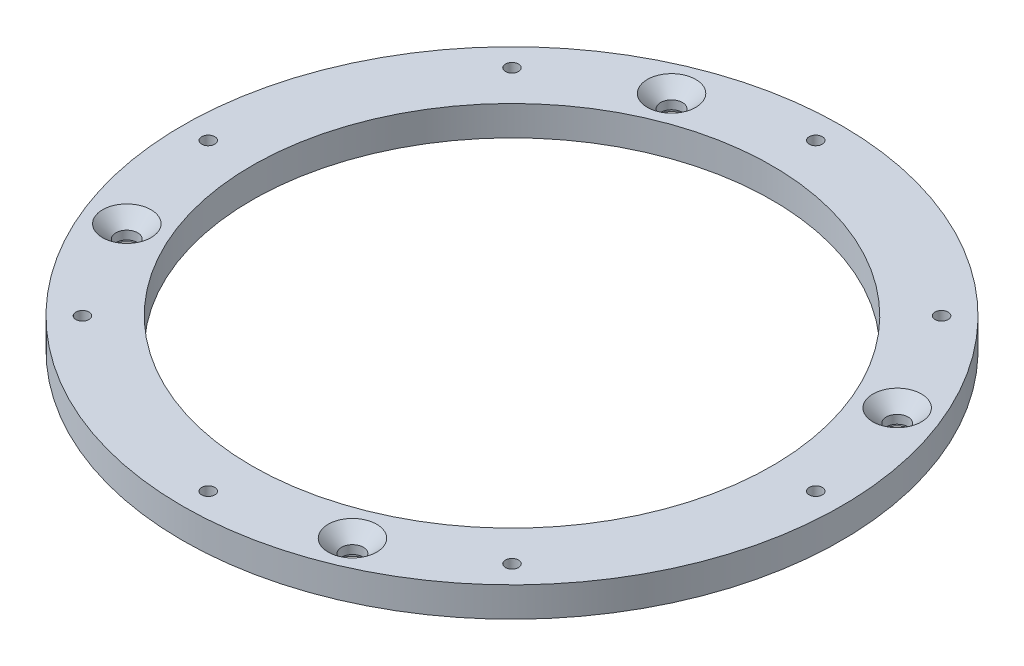
ISO-10303-21;
HEADER;
FILE_DESCRIPTION(('STEP AP214'),'2;1');
FILE_NAME('part.step','',(''),(''),'','','');
FILE_SCHEMA(('AUTOMOTIVE_DESIGN { 1 0 10303 214 1 1 1 1 }'));
ENDSEC;
DATA;
#1=APPLICATION_CONTEXT('core data for automotive mechanical design processes');
#2=APPLICATION_PROTOCOL_DEFINITION('international standard','automotive_design',2000,#1);
#3=PRODUCT_CONTEXT('',#1,'mechanical');
#4=PRODUCT('Part','Part','',(#3));
#5=PRODUCT_RELATED_PRODUCT_CATEGORY('part','',(#4));
#6=PRODUCT_DEFINITION_FORMATION('','',#4);
#7=PRODUCT_DEFINITION_CONTEXT('part definition',#1,'design');
#8=PRODUCT_DEFINITION('design','',#6,#7);
#9=PRODUCT_DEFINITION_SHAPE('','',#8);
#10=(LENGTH_UNIT() NAMED_UNIT(*) SI_UNIT(.MILLI.,.METRE.));
#11=(NAMED_UNIT(*) PLANE_ANGLE_UNIT() SI_UNIT($,.RADIAN.));
#12=(NAMED_UNIT(*) SI_UNIT($,.STERADIAN.) SOLID_ANGLE_UNIT());
#13=UNCERTAINTY_MEASURE_WITH_UNIT(LENGTH_MEASURE(1.E-05),#10,'distance_accuracy_value','');
#14=(GEOMETRIC_REPRESENTATION_CONTEXT(3) GLOBAL_UNCERTAINTY_ASSIGNED_CONTEXT((#13)) GLOBAL_UNIT_ASSIGNED_CONTEXT((#10,
#11,#12)) REPRESENTATION_CONTEXT('',''));
#15=CARTESIAN_POINT('',(0.,0.,0.));
#16=DIRECTION('',(0.,0.,1.));
#17=DIRECTION('',(1.,0.,0.));
#18=AXIS2_PLACEMENT_3D('',#15,#16,#17);
#19=CARTESIAN_POINT('',(0.,15.,0.));
#20=DIRECTION('',(0.,1.,0.));
#21=DIRECTION('',(0.,0.,1.));
#22=AXIS2_PLACEMENT_3D('',#19,#20,#21);
#23=PLANE('',#22);
#24=CARTESIAN_POINT('',(-56.8284897062179,15.,-137.196110577925));
#25=DIRECTION('',(0.,1.,0.));
#26=DIRECTION('',(0.,0.,1.));
#27=AXIS2_PLACEMENT_3D('',#24,#25,#26);
#28=CIRCLE('',#27,12.2);
#29=CARTESIAN_POINT('',(-56.8284897062179,15.,-124.996110577925));
#30=VERTEX_POINT('',#29);
#31=EDGE_CURVE('E184',#30,#30,#28,.T.);
#32=ORIENTED_EDGE('',*,*,#31,.F.);
#33=EDGE_LOOP('',(#32));
#34=FACE_BOUND('',#33,.T.);
#35=CARTESIAN_POINT('',(137.196110577926,15.,-56.8284897062164));
#36=DIRECTION('',(0.,1.,0.));
#37=DIRECTION('',(0.,0.,1.));
#38=AXIS2_PLACEMENT_3D('',#35,#36,#37);
#39=CIRCLE('',#38,12.2);
#40=CARTESIAN_POINT('',(137.196110577926,15.,-44.6284897062164));
#41=VERTEX_POINT('',#40);
#42=EDGE_CURVE('E70',#41,#41,#39,.T.);
#43=ORIENTED_EDGE('',*,*,#42,.F.);
#44=EDGE_LOOP('',(#43));
#45=FACE_BOUND('',#44,.T.);
#46=CARTESIAN_POINT('',(56.8284897062169,15.,137.196110577926));
#47=DIRECTION('',(0.,1.,0.));
#48=DIRECTION('',(0.,0.,1.));
#49=AXIS2_PLACEMENT_3D('',#46,#47,#48);
#50=CIRCLE('',#49,12.2);
#51=CARTESIAN_POINT('',(56.8284897062169,15.,149.396110577926));
#52=VERTEX_POINT('',#51);
#53=EDGE_CURVE('E63',#52,#52,#50,.T.);
#54=ORIENTED_EDGE('',*,*,#53,.F.);
#55=EDGE_LOOP('',(#54));
#56=FACE_BOUND('',#55,.T.);
#57=CARTESIAN_POINT('',(-137.196110577926,15.,56.8284897062164));
#58=DIRECTION('',(0.,1.,0.));
#59=DIRECTION('',(0.,0.,1.));
#60=AXIS2_PLACEMENT_3D('',#57,#58,#59);
#61=CIRCLE('',#60,12.2);
#62=CARTESIAN_POINT('',(-137.196110577926,15.,69.0284897062164));
#63=VERTEX_POINT('',#62);
#64=EDGE_CURVE('E83',#63,#63,#61,.T.);
#65=ORIENTED_EDGE('',*,*,#64,.F.);
#66=EDGE_LOOP('',(#65));
#67=FACE_BOUND('',#66,.T.);
#68=CARTESIAN_POINT('',(108.18733752154,15.,-108.187337521543));
#69=DIRECTION('',(0.,-1.,0.));
#70=DIRECTION('',(0.,0.,-1.));
#71=AXIS2_PLACEMENT_3D('',#68,#69,#70);
#72=CIRCLE('',#71,3.3);
#73=CARTESIAN_POINT('',(108.18733752154,15.,-111.487337521543));
#74=VERTEX_POINT('',#73);
#75=EDGE_CURVE('E110',#74,#74,#72,.T.);
#76=ORIENTED_EDGE('',*,*,#75,.T.);
#77=EDGE_LOOP('',(#76));
#78=FACE_BOUND('',#77,.T.);
#79=CARTESIAN_POINT('',(153.,15.,-1.602589934529E-12));
#80=DIRECTION('',(0.,-1.,0.));
#81=DIRECTION('',(0.,0.,-1.));
#82=AXIS2_PLACEMENT_3D('',#79,#80,#81);
#83=CIRCLE('',#82,3.3);
#84=CARTESIAN_POINT('',(153.,15.,-3.3000000000016));
#85=VERTEX_POINT('',#84);
#86=EDGE_CURVE('E116',#85,#85,#83,.T.);
#87=ORIENTED_EDGE('',*,*,#86,.T.);
#88=EDGE_LOOP('',(#87));
#89=FACE_BOUND('',#88,.T.);
#90=CARTESIAN_POINT('',(108.187337521543,15.,108.187337521541));
#91=DIRECTION('',(0.,-1.,0.));
#92=DIRECTION('',(0.,0.,-1.));
#93=AXIS2_PLACEMENT_3D('',#90,#91,#92);
#94=CIRCLE('',#93,3.3);
#95=CARTESIAN_POINT('',(108.187337521543,15.,104.887337521541));
#96=VERTEX_POINT('',#95);
#97=EDGE_CURVE('E122',#96,#96,#94,.T.);
#98=ORIENTED_EDGE('',*,*,#97,.T.);
#99=EDGE_LOOP('',(#98));
#100=FACE_BOUND('',#99,.T.);
#101=CARTESIAN_POINT('',(0.,15.,153.));
#102=DIRECTION('',(0.,-1.,0.));
#103=DIRECTION('',(0.,0.,-1.));
#104=AXIS2_PLACEMENT_3D('',#101,#102,#103);
#105=CIRCLE('',#104,3.3);
#106=CARTESIAN_POINT('',(0.,15.,149.7));
#107=VERTEX_POINT('',#106);
#108=EDGE_CURVE('E128',#107,#107,#105,.T.);
#109=ORIENTED_EDGE('',*,*,#108,.T.);
#110=EDGE_LOOP('',(#109));
#111=FACE_BOUND('',#110,.T.);
#112=CARTESIAN_POINT('',(-108.187337521541,15.,108.187337521542));
#113=DIRECTION('',(0.,-1.,0.));
#114=DIRECTION('',(0.,0.,-1.));
#115=AXIS2_PLACEMENT_3D('',#112,#113,#114);
#116=CIRCLE('',#115,3.3);
#117=CARTESIAN_POINT('',(-108.187337521541,15.,104.887337521542));
#118=VERTEX_POINT('',#117);
#119=EDGE_CURVE('E134',#118,#118,#116,.T.);
#120=ORIENTED_EDGE('',*,*,#119,.T.);
#121=EDGE_LOOP('',(#120));
#122=FACE_BOUND('',#121,.T.);
#123=CARTESIAN_POINT('',(-153.,15.,5.34196644842999E-13));
#124=DIRECTION('',(0.,-1.,0.));
#125=DIRECTION('',(0.,0.,-1.));
#126=AXIS2_PLACEMENT_3D('',#123,#124,#125);
#127=CIRCLE('',#126,3.3);
#128=CARTESIAN_POINT('',(-153.,15.,-3.29999999999946));
#129=VERTEX_POINT('',#128);
#130=EDGE_CURVE('E140',#129,#129,#127,.T.);
#131=ORIENTED_EDGE('',*,*,#130,.T.);
#132=EDGE_LOOP('',(#131));
#133=FACE_BOUND('',#132,.T.);
#134=CARTESIAN_POINT('',(-108.187337521542,15.,-108.187337521542));
#135=DIRECTION('',(0.,-1.,0.));
#136=DIRECTION('',(0.,0.,-1.));
#137=AXIS2_PLACEMENT_3D('',#134,#135,#136);
#138=CIRCLE('',#137,3.3);
#139=CARTESIAN_POINT('',(-108.187337521542,15.,-111.487337521542));
#140=VERTEX_POINT('',#139);
#141=EDGE_CURVE('E146',#140,#140,#138,.T.);
#142=ORIENTED_EDGE('',*,*,#141,.T.);
#143=EDGE_LOOP('',(#142));
#144=FACE_BOUND('',#143,.T.);
#145=CARTESIAN_POINT('',(0.,15.,-153.));
#146=DIRECTION('',(0.,-1.,0.));
#147=DIRECTION('',(0.,0.,-1.));
#148=AXIS2_PLACEMENT_3D('',#145,#146,#147);
#149=CIRCLE('',#148,3.3);
#150=CARTESIAN_POINT('',(0.,15.,-156.3));
#151=VERTEX_POINT('',#150);
#152=EDGE_CURVE('E152',#151,#151,#149,.T.);
#153=ORIENTED_EDGE('',*,*,#152,.T.);
#154=EDGE_LOOP('',(#153));
#155=FACE_BOUND('',#154,.T.);
#156=CARTESIAN_POINT('',(0.,15.,0.));
#157=DIRECTION('',(0.,1.,0.));
#158=DIRECTION('',(0.,0.,1.));
#159=AXIS2_PLACEMENT_3D('',#156,#157,#158);
#160=CIRCLE('',#159,166.);
#161=CARTESIAN_POINT('',(0.,15.,166.));
#162=VERTEX_POINT('',#161);
#163=EDGE_CURVE('E10',#162,#162,#160,.T.);
#164=ORIENTED_EDGE('',*,*,#163,.T.);
#165=EDGE_LOOP('',(#164));
#166=FACE_BOUND('',#165,.T.);
#167=CARTESIAN_POINT('',(0.,15.,0.));
#168=DIRECTION('',(0.,1.,0.));
#169=DIRECTION('',(0.,0.,1.));
#170=AXIS2_PLACEMENT_3D('',#167,#168,#169);
#171=CIRCLE('',#170,131.);
#172=CARTESIAN_POINT('',(0.,15.,131.));
#173=VERTEX_POINT('',#172);
#174=EDGE_CURVE('E46',#173,#173,#171,.T.);
#175=ORIENTED_EDGE('',*,*,#174,.F.);
#176=EDGE_LOOP('',(#175));
#177=FACE_BOUND('',#176,.T.);
#178=ADVANCED_FACE('F33',(#34,#45,#56,#67,#78,#89,#100,#111,#122,#133,#144,#155,#166,#177),#23,.T.);
#179=CARTESIAN_POINT('',(0.,0.,0.));
#180=DIRECTION('',(0.,1.,0.));
#181=DIRECTION('',(0.,0.,1.));
#182=AXIS2_PLACEMENT_3D('',#179,#180,#181);
#183=PLANE('',#182);
#184=CARTESIAN_POINT('',(56.8284897062169,0.,137.196110577926));
#185=DIRECTION('',(0.,-1.,0.));
#186=DIRECTION('',(-1.,0.,0.));
#187=AXIS2_PLACEMENT_3D('',#184,#185,#186);
#188=CIRCLE('',#187,9.99999999999998);
#189=CARTESIAN_POINT('',(46.8284897062169,0.,137.196110577926));
#190=VERTEX_POINT('',#189);
#191=EDGE_CURVE('E84',#190,#190,#188,.T.);
#192=ORIENTED_EDGE('',*,*,#191,.F.);
#193=EDGE_LOOP('',(#192));
#194=FACE_BOUND('',#193,.T.);
#195=CARTESIAN_POINT('',(137.196110577926,0.,-56.8284897062164));
#196=DIRECTION('',(0.,-1.,0.));
#197=DIRECTION('',(0.,0.,1.));
#198=AXIS2_PLACEMENT_3D('',#195,#196,#197);
#199=CIRCLE('',#198,9.99999999999998);
#200=CARTESIAN_POINT('',(137.196110577926,0.,-46.8284897062164));
#201=VERTEX_POINT('',#200);
#202=EDGE_CURVE('E90',#201,#201,#199,.T.);
#203=ORIENTED_EDGE('',*,*,#202,.F.);
#204=EDGE_LOOP('',(#203));
#205=FACE_BOUND('',#204,.T.);
#206=CARTESIAN_POINT('',(-56.8284897062179,0.,-137.196110577925));
#207=DIRECTION('',(0.,-1.,0.));
#208=DIRECTION('',(1.,0.,0.));
#209=AXIS2_PLACEMENT_3D('',#206,#207,#208);
#210=CIRCLE('',#209,9.99999999999998);
#211=CARTESIAN_POINT('',(-46.8284897062179,0.,-137.196110577925));
#212=VERTEX_POINT('',#211);
#213=EDGE_CURVE('E59',#212,#212,#210,.T.);
#214=ORIENTED_EDGE('',*,*,#213,.F.);
#215=EDGE_LOOP('',(#214));
#216=FACE_BOUND('',#215,.T.);
#217=CARTESIAN_POINT('',(-137.196110577926,0.,56.8284897062164));
#218=DIRECTION('',(0.,-1.,0.));
#219=DIRECTION('',(0.,0.,-1.));
#220=AXIS2_PLACEMENT_3D('',#217,#218,#219);
#221=CIRCLE('',#220,9.99999999999998);
#222=CARTESIAN_POINT('',(-137.196110577926,0.,46.8284897062164));
#223=VERTEX_POINT('',#222);
#224=EDGE_CURVE('E55',#223,#223,#221,.T.);
#225=ORIENTED_EDGE('',*,*,#224,.F.);
#226=EDGE_LOOP('',(#225));
#227=FACE_BOUND('',#226,.T.);
#228=CARTESIAN_POINT('',(108.18733752154,0.,-108.187337521543));
#229=DIRECTION('',(0.,-1.,0.));
#230=DIRECTION('',(0.,0.,-1.));
#231=AXIS2_PLACEMENT_3D('',#228,#229,#230);
#232=CIRCLE('',#231,3.3);
#233=CARTESIAN_POINT('',(108.18733752154,0.,-111.487337521543));
#234=VERTEX_POINT('',#233);
#235=EDGE_CURVE('E105',#234,#234,#232,.T.);
#236=ORIENTED_EDGE('',*,*,#235,.F.);
#237=EDGE_LOOP('',(#236));
#238=FACE_BOUND('',#237,.T.);
#239=CARTESIAN_POINT('',(153.,0.,-1.602589934529E-12));
#240=DIRECTION('',(0.,-1.,0.));
#241=DIRECTION('',(0.,0.,-1.));
#242=AXIS2_PLACEMENT_3D('',#239,#240,#241);
#243=CIRCLE('',#242,3.3);
#244=CARTESIAN_POINT('',(153.,0.,-3.3000000000016));
#245=VERTEX_POINT('',#244);
#246=EDGE_CURVE('E113',#245,#245,#243,.T.);
#247=ORIENTED_EDGE('',*,*,#246,.F.);
#248=EDGE_LOOP('',(#247));
#249=FACE_BOUND('',#248,.T.);
#250=CARTESIAN_POINT('',(108.187337521543,0.,108.187337521541));
#251=DIRECTION('',(0.,-1.,0.));
#252=DIRECTION('',(0.,0.,-1.));
#253=AXIS2_PLACEMENT_3D('',#250,#251,#252);
#254=CIRCLE('',#253,3.3);
#255=CARTESIAN_POINT('',(108.187337521543,0.,104.887337521541));
#256=VERTEX_POINT('',#255);
#257=EDGE_CURVE('E119',#256,#256,#254,.T.);
#258=ORIENTED_EDGE('',*,*,#257,.F.);
#259=EDGE_LOOP('',(#258));
#260=FACE_BOUND('',#259,.T.);
#261=CARTESIAN_POINT('',(0.,0.,153.));
#262=DIRECTION('',(0.,-1.,0.));
#263=DIRECTION('',(0.,0.,-1.));
#264=AXIS2_PLACEMENT_3D('',#261,#262,#263);
#265=CIRCLE('',#264,3.3);
#266=CARTESIAN_POINT('',(0.,0.,149.7));
#267=VERTEX_POINT('',#266);
#268=EDGE_CURVE('E125',#267,#267,#265,.T.);
#269=ORIENTED_EDGE('',*,*,#268,.F.);
#270=EDGE_LOOP('',(#269));
#271=FACE_BOUND('',#270,.T.);
#272=CARTESIAN_POINT('',(-108.187337521541,0.,108.187337521542));
#273=DIRECTION('',(0.,-1.,0.));
#274=DIRECTION('',(0.,0.,-1.));
#275=AXIS2_PLACEMENT_3D('',#272,#273,#274);
#276=CIRCLE('',#275,3.3);
#277=CARTESIAN_POINT('',(-108.187337521541,0.,104.887337521542));
#278=VERTEX_POINT('',#277);
#279=EDGE_CURVE('E131',#278,#278,#276,.T.);
#280=ORIENTED_EDGE('',*,*,#279,.F.);
#281=EDGE_LOOP('',(#280));
#282=FACE_BOUND('',#281,.T.);
#283=CARTESIAN_POINT('',(-153.,0.,5.34196644842999E-13));
#284=DIRECTION('',(0.,-1.,0.));
#285=DIRECTION('',(0.,0.,-1.));
#286=AXIS2_PLACEMENT_3D('',#283,#284,#285);
#287=CIRCLE('',#286,3.3);
#288=CARTESIAN_POINT('',(-153.,0.,-3.29999999999946));
#289=VERTEX_POINT('',#288);
#290=EDGE_CURVE('E137',#289,#289,#287,.T.);
#291=ORIENTED_EDGE('',*,*,#290,.F.);
#292=EDGE_LOOP('',(#291));
#293=FACE_BOUND('',#292,.T.);
#294=CARTESIAN_POINT('',(-108.187337521542,0.,-108.187337521542));
#295=DIRECTION('',(0.,-1.,0.));
#296=DIRECTION('',(0.,0.,-1.));
#297=AXIS2_PLACEMENT_3D('',#294,#295,#296);
#298=CIRCLE('',#297,3.3);
#299=CARTESIAN_POINT('',(-108.187337521542,0.,-111.487337521542));
#300=VERTEX_POINT('',#299);
#301=EDGE_CURVE('E143',#300,#300,#298,.T.);
#302=ORIENTED_EDGE('',*,*,#301,.F.);
#303=EDGE_LOOP('',(#302));
#304=FACE_BOUND('',#303,.T.);
#305=CARTESIAN_POINT('',(0.,0.,-153.));
#306=DIRECTION('',(0.,-1.,0.));
#307=DIRECTION('',(0.,0.,-1.));
#308=AXIS2_PLACEMENT_3D('',#305,#306,#307);
#309=CIRCLE('',#308,3.3);
#310=CARTESIAN_POINT('',(0.,0.,-156.3));
#311=VERTEX_POINT('',#310);
#312=EDGE_CURVE('E149',#311,#311,#309,.T.);
#313=ORIENTED_EDGE('',*,*,#312,.F.);
#314=EDGE_LOOP('',(#313));
#315=FACE_BOUND('',#314,.T.);
#316=CARTESIAN_POINT('',(0.,0.,0.));
#317=DIRECTION('',(0.,1.,0.));
#318=DIRECTION('',(0.,0.,1.));
#319=AXIS2_PLACEMENT_3D('',#316,#317,#318);
#320=CIRCLE('',#319,166.);
#321=CARTESIAN_POINT('',(0.,0.,166.));
#322=VERTEX_POINT('',#321);
#323=EDGE_CURVE('E41',#322,#322,#320,.T.);
#324=ORIENTED_EDGE('',*,*,#323,.F.);
#325=EDGE_LOOP('',(#324));
#326=FACE_BOUND('',#325,.T.);
#327=CARTESIAN_POINT('',(0.,0.,0.));
#328=DIRECTION('',(0.,1.,0.));
#329=DIRECTION('',(0.,0.,1.));
#330=AXIS2_PLACEMENT_3D('',#327,#328,#329);
#331=CIRCLE('',#330,131.);
#332=CARTESIAN_POINT('',(0.,0.,131.));
#333=VERTEX_POINT('',#332);
#334=EDGE_CURVE('E49',#333,#333,#331,.T.);
#335=ORIENTED_EDGE('',*,*,#334,.T.);
#336=EDGE_LOOP('',(#335));
#337=FACE_BOUND('',#336,.T.);
#338=ADVANCED_FACE('F160',(#194,#205,#216,#227,#238,#249,#260,#271,#282,#293,#304,#315,#326,
#337),#183,.F.);
#339=CARTESIAN_POINT('',(0.,15.,0.));
#340=DIRECTION('',(0.,-1.,0.));
#341=DIRECTION('',(0.,0.,-1.));
#342=AXIS2_PLACEMENT_3D('',#339,#340,#341);
#343=CYLINDRICAL_SURFACE('',#342,166.);
#344=ORIENTED_EDGE('',*,*,#163,.F.);
#345=EDGE_LOOP('',(#344));
#346=FACE_BOUND('',#345,.T.);
#347=ORIENTED_EDGE('',*,*,#323,.T.);
#348=EDGE_LOOP('',(#347));
#349=FACE_BOUND('',#348,.T.);
#350=ADVANCED_FACE('F35',(#346,#349),#343,.T.);
#351=CARTESIAN_POINT('',(0.,15.,0.));
#352=DIRECTION('',(0.,-1.,0.));
#353=DIRECTION('',(0.,0.,-1.));
#354=AXIS2_PLACEMENT_3D('',#351,#352,#353);
#355=CYLINDRICAL_SURFACE('',#354,131.);
#356=ORIENTED_EDGE('',*,*,#174,.T.);
#357=EDGE_LOOP('',(#356));
#358=FACE_BOUND('',#357,.T.);
#359=ORIENTED_EDGE('',*,*,#334,.F.);
#360=EDGE_LOOP('',(#359));
#361=FACE_BOUND('',#360,.T.);
#362=ADVANCED_FACE('F162',(#358,#361),#355,.F.);
#363=CARTESIAN_POINT('',(0.,0.,-153.));
#364=DIRECTION('',(0.,-1.,0.));
#365=DIRECTION('',(0.,0.,-1.));
#366=AXIS2_PLACEMENT_3D('',#363,#364,#365);
#367=CYLINDRICAL_SURFACE('',#366,3.3);
#368=ORIENTED_EDGE('',*,*,#152,.F.);
#369=EDGE_LOOP('',(#368));
#370=FACE_BOUND('',#369,.T.);
#371=ORIENTED_EDGE('',*,*,#312,.T.);
#372=EDGE_LOOP('',(#371));
#373=FACE_BOUND('',#372,.T.);
#374=ADVANCED_FACE('F164',(#370,#373),#367,.F.);
#375=CARTESIAN_POINT('',(-108.187337521542,0.,-108.187337521542));
#376=DIRECTION('',(0.,-1.,0.));
#377=DIRECTION('',(0.,0.,-1.));
#378=AXIS2_PLACEMENT_3D('',#375,#376,#377);
#379=CYLINDRICAL_SURFACE('',#378,3.3);
#380=ORIENTED_EDGE('',*,*,#141,.F.);
#381=EDGE_LOOP('',(#380));
#382=FACE_BOUND('',#381,.T.);
#383=ORIENTED_EDGE('',*,*,#301,.T.);
#384=EDGE_LOOP('',(#383));
#385=FACE_BOUND('',#384,.T.);
#386=ADVANCED_FACE('F170',(#382,#385),#379,.F.);
#387=CARTESIAN_POINT('',(-153.,0.,5.34196644842999E-13));
#388=DIRECTION('',(0.,-1.,0.));
#389=DIRECTION('',(0.,0.,-1.));
#390=AXIS2_PLACEMENT_3D('',#387,#388,#389);
#391=CYLINDRICAL_SURFACE('',#390,3.3);
#392=ORIENTED_EDGE('',*,*,#130,.F.);
#393=EDGE_LOOP('',(#392));
#394=FACE_BOUND('',#393,.T.);
#395=ORIENTED_EDGE('',*,*,#290,.T.);
#396=EDGE_LOOP('',(#395));
#397=FACE_BOUND('',#396,.T.);
#398=ADVANCED_FACE('F216',(#394,#397),#391,.F.);
#399=CARTESIAN_POINT('',(-108.187337521541,0.,108.187337521542));
#400=DIRECTION('',(0.,-1.,0.));
#401=DIRECTION('',(0.,0.,-1.));
#402=AXIS2_PLACEMENT_3D('',#399,#400,#401);
#403=CYLINDRICAL_SURFACE('',#402,3.3);
#404=ORIENTED_EDGE('',*,*,#119,.F.);
#405=EDGE_LOOP('',(#404));
#406=FACE_BOUND('',#405,.T.);
#407=ORIENTED_EDGE('',*,*,#279,.T.);
#408=EDGE_LOOP('',(#407));
#409=FACE_BOUND('',#408,.T.);
#410=ADVANCED_FACE('F223',(#406,#409),#403,.F.);
#411=CARTESIAN_POINT('',(0.,0.,153.));
#412=DIRECTION('',(0.,-1.,0.));
#413=DIRECTION('',(0.,0.,-1.));
#414=AXIS2_PLACEMENT_3D('',#411,#412,#413);
#415=CYLINDRICAL_SURFACE('',#414,3.3);
#416=ORIENTED_EDGE('',*,*,#108,.F.);
#417=EDGE_LOOP('',(#416));
#418=FACE_BOUND('',#417,.T.);
#419=ORIENTED_EDGE('',*,*,#268,.T.);
#420=EDGE_LOOP('',(#419));
#421=FACE_BOUND('',#420,.T.);
#422=ADVANCED_FACE('F229',(#418,#421),#415,.F.);
#423=CARTESIAN_POINT('',(108.187337521543,0.,108.187337521541));
#424=DIRECTION('',(0.,-1.,0.));
#425=DIRECTION('',(0.,0.,-1.));
#426=AXIS2_PLACEMENT_3D('',#423,#424,#425);
#427=CYLINDRICAL_SURFACE('',#426,3.3);
#428=ORIENTED_EDGE('',*,*,#97,.F.);
#429=EDGE_LOOP('',(#428));
#430=FACE_BOUND('',#429,.T.);
#431=ORIENTED_EDGE('',*,*,#257,.T.);
#432=EDGE_LOOP('',(#431));
#433=FACE_BOUND('',#432,.T.);
#434=ADVANCED_FACE('F233',(#430,#433),#427,.F.);
#435=CARTESIAN_POINT('',(153.,0.,-1.602589934529E-12));
#436=DIRECTION('',(0.,-1.,0.));
#437=DIRECTION('',(0.,0.,-1.));
#438=AXIS2_PLACEMENT_3D('',#435,#436,#437);
#439=CYLINDRICAL_SURFACE('',#438,3.3);
#440=ORIENTED_EDGE('',*,*,#86,.F.);
#441=EDGE_LOOP('',(#440));
#442=FACE_BOUND('',#441,.T.);
#443=ORIENTED_EDGE('',*,*,#246,.T.);
#444=EDGE_LOOP('',(#443));
#445=FACE_BOUND('',#444,.T.);
#446=ADVANCED_FACE('F237',(#442,#445),#439,.F.);
#447=CARTESIAN_POINT('',(108.18733752154,0.,-108.187337521543));
#448=DIRECTION('',(0.,-1.,0.));
#449=DIRECTION('',(0.,0.,-1.));
#450=AXIS2_PLACEMENT_3D('',#447,#448,#449);
#451=CYLINDRICAL_SURFACE('',#450,3.3);
#452=ORIENTED_EDGE('',*,*,#75,.F.);
#453=EDGE_LOOP('',(#452));
#454=FACE_BOUND('',#453,.T.);
#455=ORIENTED_EDGE('',*,*,#235,.T.);
#456=EDGE_LOOP('',(#455));
#457=FACE_BOUND('',#456,.T.);
#458=ADVANCED_FACE('F241',(#454,#457),#451,.F.);
#459=CARTESIAN_POINT('',(-137.196110577926,4.,56.8284897062164));
#460=DIRECTION('',(0.,-1.,0.));
#461=DIRECTION('',(0.,0.,-1.));
#462=AXIS2_PLACEMENT_3D('',#459,#460,#461);
#463=CYLINDRICAL_SURFACE('',#462,9.99999999999998);
#464=CARTESIAN_POINT('',(-137.196110577926,4.,56.8284897062164));
#465=DIRECTION('',(0.,-1.,0.));
#466=DIRECTION('',(0.,0.,-1.));
#467=AXIS2_PLACEMENT_3D('',#464,#465,#466);
#468=CIRCLE('',#467,9.99999999999998);
#469=CARTESIAN_POINT('',(-137.196110577926,4.,46.8284897062164));
#470=VERTEX_POINT('',#469);
#471=EDGE_CURVE('E102',#470,#470,#468,.T.);
#472=ORIENTED_EDGE('',*,*,#471,.F.);
#473=EDGE_LOOP('',(#472));
#474=FACE_BOUND('',#473,.T.);
#475=ORIENTED_EDGE('',*,*,#224,.T.);
#476=EDGE_LOOP('',(#475));
#477=FACE_BOUND('',#476,.T.);
#478=ADVANCED_FACE('F245',(#474,#477),#463,.F.);
#479=CARTESIAN_POINT('',(-137.196110577926,4.,56.8284897062164));
#480=DIRECTION('',(0.,-1.,0.));
#481=DIRECTION('',(0.,0.,-1.));
#482=AXIS2_PLACEMENT_3D('',#479,#480,#481);
#483=PLANE('',#482);
#484=CARTESIAN_POINT('',(-137.196110577926,4.,56.8284897062164));
#485=DIRECTION('',(0.,-1.,0.));
#486=DIRECTION('',(0.,0.,-1.));
#487=AXIS2_PLACEMENT_3D('',#484,#485,#486);
#488=CIRCLE('',#487,5.50000000000001);
#489=CARTESIAN_POINT('',(-137.196110577926,4.,51.3284897062164));
#490=VERTEX_POINT('',#489);
#491=EDGE_CURVE('E52',#490,#490,#488,.T.);
#492=ORIENTED_EDGE('',*,*,#491,.F.);
#493=EDGE_LOOP('',(#492));
#494=FACE_BOUND('',#493,.T.);
#495=ORIENTED_EDGE('',*,*,#471,.T.);
#496=EDGE_LOOP('',(#495));
#497=FACE_BOUND('',#496,.T.);
#498=ADVANCED_FACE('F249',(#494,#497),#483,.T.);
#499=CARTESIAN_POINT('',(-137.196110577926,15.,56.8284897062164));
#500=DIRECTION('',(0.,1.,0.));
#501=DIRECTION('',(0.,0.,1.));
#502=AXIS2_PLACEMENT_3D('',#499,#500,#501);
#503=CYLINDRICAL_SURFACE('',#502,5.50000000000001);
#504=ORIENTED_EDGE('',*,*,#491,.T.);
#505=EDGE_LOOP('',(#504));
#506=FACE_BOUND('',#505,.T.);
#507=CARTESIAN_POINT('',(-137.196110577926,8.3,56.8284897062164));
#508=DIRECTION('',(0.,1.,0.));
#509=DIRECTION('',(0.,0.,1.));
#510=AXIS2_PLACEMENT_3D('',#507,#508,#509);
#511=CIRCLE('',#510,5.50000000000001);
#512=CARTESIAN_POINT('',(-137.196110577926,8.3,62.3284897062164));
#513=VERTEX_POINT('',#512);
#514=EDGE_CURVE('E56',#513,#513,#511,.T.);
#515=ORIENTED_EDGE('',*,*,#514,.T.);
#516=EDGE_LOOP('',(#515));
#517=FACE_BOUND('',#516,.T.);
#518=ADVANCED_FACE('F253',(#506,#517),#503,.F.);
#519=CARTESIAN_POINT('',(-137.196110577926,15.,56.8284897062164));
#520=DIRECTION('',(0.,1.,0.));
#521=DIRECTION('',(0.,0.,1.));
#522=AXIS2_PLACEMENT_3D('',#519,#520,#521);
#523=CONICAL_SURFACE('',#522,12.2,0.785398163397448);
#524=ORIENTED_EDGE('',*,*,#514,.F.);
#525=EDGE_LOOP('',(#524));
#526=FACE_BOUND('',#525,.T.);
#527=ORIENTED_EDGE('',*,*,#64,.T.);
#528=EDGE_LOOP('',(#527));
#529=FACE_BOUND('',#528,.T.);
#530=ADVANCED_FACE('F257',(#526,#529),#523,.F.);
#531=CARTESIAN_POINT('',(-56.8284897062179,4.,-137.196110577925));
#532=DIRECTION('',(0.,-1.,0.));
#533=DIRECTION('',(0.,0.,-1.));
#534=AXIS2_PLACEMENT_3D('',#531,#532,#533);
#535=CYLINDRICAL_SURFACE('',#534,9.99999999999998);
#536=CARTESIAN_POINT('',(-56.8284897062179,4.,-137.196110577925));
#537=DIRECTION('',(0.,-1.,0.));
#538=DIRECTION('',(1.,0.,0.));
#539=AXIS2_PLACEMENT_3D('',#536,#537,#538);
#540=CIRCLE('',#539,9.99999999999998);
#541=CARTESIAN_POINT('',(-46.8284897062179,4.,-137.196110577925));
#542=VERTEX_POINT('',#541);
#543=EDGE_CURVE('E93',#542,#542,#540,.T.);
#544=ORIENTED_EDGE('',*,*,#543,.F.);
#545=EDGE_LOOP('',(#544));
#546=FACE_BOUND('',#545,.T.);
#547=ORIENTED_EDGE('',*,*,#213,.T.);
#548=EDGE_LOOP('',(#547));
#549=FACE_BOUND('',#548,.T.);
#550=ADVANCED_FACE('F261',(#546,#549),#535,.F.);
#551=CARTESIAN_POINT('',(-56.8284897062179,4.,-137.196110577925));
#552=DIRECTION('',(0.,-1.,0.));
#553=DIRECTION('',(1.,0.,0.));
#554=AXIS2_PLACEMENT_3D('',#551,#552,#553);
#555=PLANE('',#554);
#556=CARTESIAN_POINT('',(-56.8284897062179,4.,-137.196110577925));
#557=DIRECTION('',(0.,-1.,0.));
#558=DIRECTION('',(0.,0.,-1.));
#559=AXIS2_PLACEMENT_3D('',#556,#557,#558);
#560=CIRCLE('',#559,5.5);
#561=CARTESIAN_POINT('',(-56.8284897062179,4.,-142.696110577925));
#562=VERTEX_POINT('',#561);
#563=EDGE_CURVE('E37',#562,#562,#560,.T.);
#564=ORIENTED_EDGE('',*,*,#563,.F.);
#565=EDGE_LOOP('',(#564));
#566=FACE_BOUND('',#565,.T.);
#567=ORIENTED_EDGE('',*,*,#543,.T.);
#568=EDGE_LOOP('',(#567));
#569=FACE_BOUND('',#568,.T.);
#570=ADVANCED_FACE('F265',(#566,#569),#555,.T.);
#571=CARTESIAN_POINT('',(137.196110577926,4.,-56.8284897062164));
#572=DIRECTION('',(0.,-1.,0.));
#573=DIRECTION('',(0.,0.,-1.));
#574=AXIS2_PLACEMENT_3D('',#571,#572,#573);
#575=CYLINDRICAL_SURFACE('',#574,9.99999999999998);
#576=CARTESIAN_POINT('',(137.196110577926,4.,-56.8284897062164));
#577=DIRECTION('',(0.,-1.,0.));
#578=DIRECTION('',(0.,0.,1.));
#579=AXIS2_PLACEMENT_3D('',#576,#577,#578);
#580=CIRCLE('',#579,9.99999999999998);
#581=CARTESIAN_POINT('',(137.196110577926,4.,-46.8284897062164));
#582=VERTEX_POINT('',#581);
#583=EDGE_CURVE('E87',#582,#582,#580,.T.);
#584=ORIENTED_EDGE('',*,*,#583,.F.);
#585=EDGE_LOOP('',(#584));
#586=FACE_BOUND('',#585,.T.);
#587=ORIENTED_EDGE('',*,*,#202,.T.);
#588=EDGE_LOOP('',(#587));
#589=FACE_BOUND('',#588,.T.);
#590=ADVANCED_FACE('F269',(#586,#589),#575,.F.);
#591=CARTESIAN_POINT('',(137.196110577926,4.,-56.8284897062164));
#592=DIRECTION('',(0.,-1.,0.));
#593=DIRECTION('',(0.,0.,1.));
#594=AXIS2_PLACEMENT_3D('',#591,#592,#593);
#595=PLANE('',#594);
#596=CARTESIAN_POINT('',(137.196110577926,4.,-56.8284897062164));
#597=DIRECTION('',(0.,-1.,0.));
#598=DIRECTION('',(0.,0.,-1.));
#599=AXIS2_PLACEMENT_3D('',#596,#597,#598);
#600=CIRCLE('',#599,5.50000000000001);
#601=CARTESIAN_POINT('',(137.196110577926,4.,-62.3284897062164));
#602=VERTEX_POINT('',#601);
#603=EDGE_CURVE('E61',#602,#602,#600,.T.);
#604=ORIENTED_EDGE('',*,*,#603,.F.);
#605=EDGE_LOOP('',(#604));
#606=FACE_BOUND('',#605,.T.);
#607=ORIENTED_EDGE('',*,*,#583,.T.);
#608=EDGE_LOOP('',(#607));
#609=FACE_BOUND('',#608,.T.);
#610=ADVANCED_FACE('F273',(#606,#609),#595,.T.);
#611=CARTESIAN_POINT('',(56.8284897062169,4.,137.196110577926));
#612=DIRECTION('',(0.,-1.,0.));
#613=DIRECTION('',(0.,0.,-1.));
#614=AXIS2_PLACEMENT_3D('',#611,#612,#613);
#615=CYLINDRICAL_SURFACE('',#614,9.99999999999998);
#616=CARTESIAN_POINT('',(56.8284897062169,4.,137.196110577926));
#617=DIRECTION('',(0.,-1.,0.));
#618=DIRECTION('',(-1.,0.,0.));
#619=AXIS2_PLACEMENT_3D('',#616,#617,#618);
#620=CIRCLE('',#619,9.99999999999998);
#621=CARTESIAN_POINT('',(46.8284897062169,4.,137.196110577926));
#622=VERTEX_POINT('',#621);
#623=EDGE_CURVE('E80',#622,#622,#620,.T.);
#624=ORIENTED_EDGE('',*,*,#623,.F.);
#625=EDGE_LOOP('',(#624));
#626=FACE_BOUND('',#625,.T.);
#627=ORIENTED_EDGE('',*,*,#191,.T.);
#628=EDGE_LOOP('',(#627));
#629=FACE_BOUND('',#628,.T.);
#630=ADVANCED_FACE('F277',(#626,#629),#615,.F.);
#631=CARTESIAN_POINT('',(56.8284897062169,4.,137.196110577926));
#632=DIRECTION('',(0.,-1.,0.));
#633=DIRECTION('',(-1.,0.,0.));
#634=AXIS2_PLACEMENT_3D('',#631,#632,#633);
#635=PLANE('',#634);
#636=CARTESIAN_POINT('',(56.8284897062169,4.,137.196110577926));
#637=DIRECTION('',(0.,-1.,0.));
#638=DIRECTION('',(0.,0.,-1.));
#639=AXIS2_PLACEMENT_3D('',#636,#637,#638);
#640=CIRCLE('',#639,5.5);
#641=CARTESIAN_POINT('',(56.8284897062169,4.,131.696110577926));
#642=VERTEX_POINT('',#641);
#643=EDGE_CURVE('E57',#642,#642,#640,.T.);
#644=ORIENTED_EDGE('',*,*,#643,.F.);
#645=EDGE_LOOP('',(#644));
#646=FACE_BOUND('',#645,.T.);
#647=ORIENTED_EDGE('',*,*,#623,.T.);
#648=EDGE_LOOP('',(#647));
#649=FACE_BOUND('',#648,.T.);
#650=ADVANCED_FACE('F281',(#646,#649),#635,.T.);
#651=CARTESIAN_POINT('',(56.8284897062169,15.,137.196110577926));
#652=DIRECTION('',(0.,1.,0.));
#653=DIRECTION('',(0.,0.,1.));
#654=AXIS2_PLACEMENT_3D('',#651,#652,#653);
#655=CYLINDRICAL_SURFACE('',#654,5.5);
#656=ORIENTED_EDGE('',*,*,#643,.T.);
#657=EDGE_LOOP('',(#656));
#658=FACE_BOUND('',#657,.T.);
#659=CARTESIAN_POINT('',(56.8284897062169,8.3,137.196110577926));
#660=DIRECTION('',(0.,1.,0.));
#661=DIRECTION('',(0.,0.,1.));
#662=AXIS2_PLACEMENT_3D('',#659,#660,#661);
#663=CIRCLE('',#662,5.5);
#664=CARTESIAN_POINT('',(56.8284897062169,8.3,142.696110577926));
#665=VERTEX_POINT('',#664);
#666=EDGE_CURVE('E60',#665,#665,#663,.T.);
#667=ORIENTED_EDGE('',*,*,#666,.T.);
#668=EDGE_LOOP('',(#667));
#669=FACE_BOUND('',#668,.T.);
#670=ADVANCED_FACE('F285',(#658,#669),#655,.F.);
#671=CARTESIAN_POINT('',(56.8284897062169,15.,137.196110577926));
#672=DIRECTION('',(0.,1.,0.));
#673=DIRECTION('',(0.,0.,1.));
#674=AXIS2_PLACEMENT_3D('',#671,#672,#673);
#675=CONICAL_SURFACE('',#674,12.2,0.785398163397448);
#676=ORIENTED_EDGE('',*,*,#666,.F.);
#677=EDGE_LOOP('',(#676));
#678=FACE_BOUND('',#677,.T.);
#679=ORIENTED_EDGE('',*,*,#53,.T.);
#680=EDGE_LOOP('',(#679));
#681=FACE_BOUND('',#680,.T.);
#682=ADVANCED_FACE('F289',(#678,#681),#675,.F.);
#683=CARTESIAN_POINT('',(137.196110577926,15.,-56.8284897062164));
#684=DIRECTION('',(0.,1.,0.));
#685=DIRECTION('',(0.,0.,1.));
#686=AXIS2_PLACEMENT_3D('',#683,#684,#685);
#687=CYLINDRICAL_SURFACE('',#686,5.50000000000001);
#688=ORIENTED_EDGE('',*,*,#603,.T.);
#689=EDGE_LOOP('',(#688));
#690=FACE_BOUND('',#689,.T.);
#691=CARTESIAN_POINT('',(137.196110577926,8.3,-56.8284897062164));
#692=DIRECTION('',(0.,1.,0.));
#693=DIRECTION('',(0.,0.,1.));
#694=AXIS2_PLACEMENT_3D('',#691,#692,#693);
#695=CIRCLE('',#694,5.50000000000001);
#696=CARTESIAN_POINT('',(137.196110577926,8.3,-51.3284897062164));
#697=VERTEX_POINT('',#696);
#698=EDGE_CURVE('E64',#697,#697,#695,.T.);
#699=ORIENTED_EDGE('',*,*,#698,.T.);
#700=EDGE_LOOP('',(#699));
#701=FACE_BOUND('',#700,.T.);
#702=ADVANCED_FACE('F293',(#690,#701),#687,.F.);
#703=CARTESIAN_POINT('',(137.196110577926,15.,-56.8284897062164));
#704=DIRECTION('',(0.,1.,0.));
#705=DIRECTION('',(0.,0.,1.));
#706=AXIS2_PLACEMENT_3D('',#703,#704,#705);
#707=CONICAL_SURFACE('',#706,12.2,0.785398163397447);
#708=ORIENTED_EDGE('',*,*,#698,.F.);
#709=EDGE_LOOP('',(#708));
#710=FACE_BOUND('',#709,.T.);
#711=ORIENTED_EDGE('',*,*,#42,.T.);
#712=EDGE_LOOP('',(#711));
#713=FACE_BOUND('',#712,.T.);
#714=ADVANCED_FACE('F297',(#710,#713),#707,.F.);
#715=CARTESIAN_POINT('',(-56.8284897062179,15.,-137.196110577925));
#716=DIRECTION('',(0.,1.,0.));
#717=DIRECTION('',(0.,0.,1.));
#718=AXIS2_PLACEMENT_3D('',#715,#716,#717);
#719=CYLINDRICAL_SURFACE('',#718,5.5);
#720=ORIENTED_EDGE('',*,*,#563,.T.);
#721=EDGE_LOOP('',(#720));
#722=FACE_BOUND('',#721,.T.);
#723=CARTESIAN_POINT('',(-56.8284897062179,8.3,-137.196110577925));
#724=DIRECTION('',(0.,1.,0.));
#725=DIRECTION('',(0.,0.,1.));
#726=AXIS2_PLACEMENT_3D('',#723,#724,#725);
#727=CIRCLE('',#726,5.5);
#728=CARTESIAN_POINT('',(-56.8284897062179,8.3,-131.696110577925));
#729=VERTEX_POINT('',#728);
#730=EDGE_CURVE('E313',#729,#729,#727,.T.);
#731=ORIENTED_EDGE('',*,*,#730,.T.);
#732=EDGE_LOOP('',(#731));
#733=FACE_BOUND('',#732,.T.);
#734=ADVANCED_FACE('F300',(#722,#733),#719,.F.);
#735=CARTESIAN_POINT('',(-56.8284897062179,15.,-137.196110577925));
#736=DIRECTION('',(0.,1.,0.));
#737=DIRECTION('',(0.,0.,1.));
#738=AXIS2_PLACEMENT_3D('',#735,#736,#737);
#739=CONICAL_SURFACE('',#738,12.2,0.785398163397448);
#740=ORIENTED_EDGE('',*,*,#730,.F.);
#741=EDGE_LOOP('',(#740));
#742=FACE_BOUND('',#741,.T.);
#743=ORIENTED_EDGE('',*,*,#31,.T.);
#744=EDGE_LOOP('',(#743));
#745=FACE_BOUND('',#744,.T.);
#746=ADVANCED_FACE('F304',(#742,#745),#739,.F.);
#747=CLOSED_SHELL('',(#178,#338,#350,#362,#374,#386,#398,#410,#422,#434,#446,#458,#478,#498,
#518,#530,#550,#570,#590,#610,#630,#650,#670,#682,#702,#714,#734,#746));
#748=MANIFOLD_SOLID_BREP('B2',#747);
#749=ADVANCED_BREP_SHAPE_REPRESENTATION('',(#18,#748),#14);
#750=SHAPE_DEFINITION_REPRESENTATION(#9,#749);
ENDSEC;
END-ISO-10303-21;
